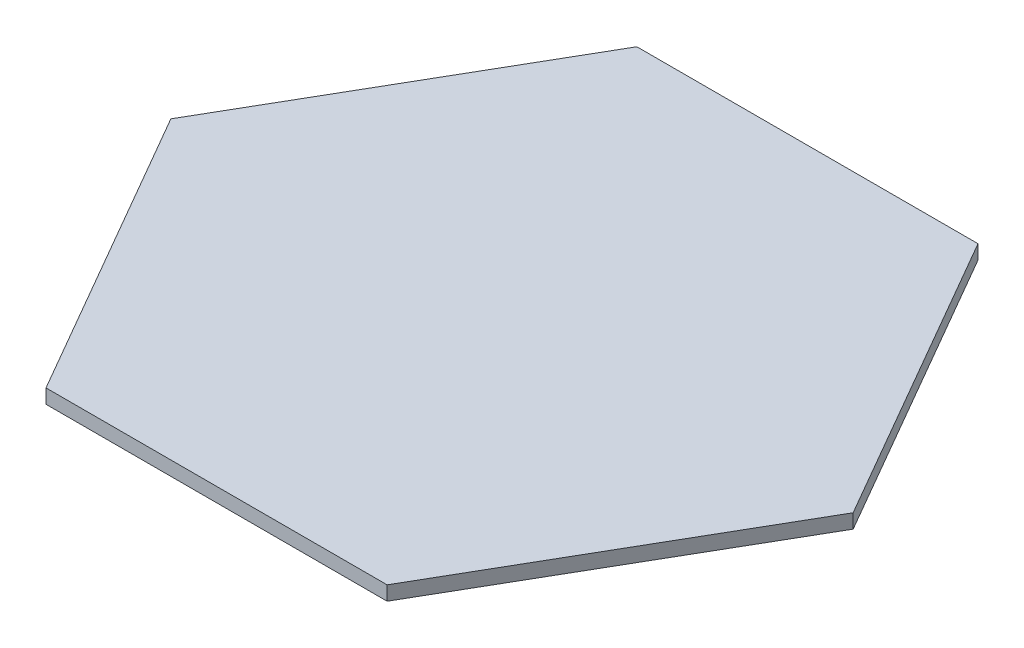
ISO-10303-21;
HEADER;
FILE_DESCRIPTION(('STEP AP214'),'2;1');
FILE_NAME('part.step','',(''),(''),'','','');
FILE_SCHEMA(('AUTOMOTIVE_DESIGN { 1 0 10303 214 1 1 1 1 }'));
ENDSEC;
DATA;
#1=APPLICATION_CONTEXT('core data for automotive mechanical design processes');
#2=APPLICATION_PROTOCOL_DEFINITION('international standard','automotive_design',2000,#1);
#3=PRODUCT_CONTEXT('',#1,'mechanical');
#4=PRODUCT('Part','Part','',(#3));
#5=PRODUCT_RELATED_PRODUCT_CATEGORY('part','',(#4));
#6=PRODUCT_DEFINITION_FORMATION('','',#4);
#7=PRODUCT_DEFINITION_CONTEXT('part definition',#1,'design');
#8=PRODUCT_DEFINITION('design','',#6,#7);
#9=PRODUCT_DEFINITION_SHAPE('','',#8);
#10=(LENGTH_UNIT() NAMED_UNIT(*) SI_UNIT(.MILLI.,.METRE.));
#11=(NAMED_UNIT(*) PLANE_ANGLE_UNIT() SI_UNIT($,.RADIAN.));
#12=(NAMED_UNIT(*) SI_UNIT($,.STERADIAN.) SOLID_ANGLE_UNIT());
#13=UNCERTAINTY_MEASURE_WITH_UNIT(LENGTH_MEASURE(1.E-05),#10,'distance_accuracy_value','');
#14=(GEOMETRIC_REPRESENTATION_CONTEXT(3) GLOBAL_UNCERTAINTY_ASSIGNED_CONTEXT((#13)) GLOBAL_UNIT_ASSIGNED_CONTEXT((#10,
#11,#12)) REPRESENTATION_CONTEXT('',''));
#15=CARTESIAN_POINT('',(0.,0.,0.));
#16=DIRECTION('',(0.,0.,1.));
#17=DIRECTION('',(1.,0.,0.));
#18=AXIS2_PLACEMENT_3D('',#15,#16,#17);
#19=CARTESIAN_POINT('',(38.1000000000007,3.175,65.9911357683737));
#20=DIRECTION('',(-0.866025403784442,0.,-0.499999999999995));
#21=DIRECTION('',(-0.499999999999995,0.,0.866025403784442));
#22=AXIS2_PLACEMENT_3D('',#19,#20,#21);
#23=PLANE('',#22);
#24=DIRECTION('',(0.499999999999995,0.,-0.866025403784442));
#25=VECTOR('',#24,1.);
#26=CARTESIAN_POINT('',(38.1000000000007,0.,65.9911357683737));
#27=LINE('',#26,#25);
#28=CARTESIAN_POINT('',(38.1000000000007,0.,65.9911357683737));
#29=VERTEX_POINT('',#28);
#30=CARTESIAN_POINT('',(76.1999999999998,0.,0.));
#31=VERTEX_POINT('',#30);
#32=EDGE_CURVE('E119',#29,#31,#27,.T.);
#33=ORIENTED_EDGE('',*,*,#32,.T.);
#34=DIRECTION('',(0.,-1.,0.));
#35=VECTOR('',#34,1.);
#36=CARTESIAN_POINT('',(76.1999999999998,3.175,0.));
#37=LINE('',#36,#35);
#38=CARTESIAN_POINT('',(76.1999999999998,3.175,0.));
#39=VERTEX_POINT('',#38);
#40=EDGE_CURVE('E11',#39,#31,#37,.T.);
#41=ORIENTED_EDGE('',*,*,#40,.F.);
#42=DIRECTION('',(0.499999999999995,0.,-0.866025403784442));
#43=VECTOR('',#42,1.);
#44=CARTESIAN_POINT('',(38.1000000000007,3.175,65.9911357683737));
#45=LINE('',#44,#43);
#46=CARTESIAN_POINT('',(38.1000000000007,3.175,65.9911357683737));
#47=VERTEX_POINT('',#46);
#48=EDGE_CURVE('E129',#47,#39,#45,.T.);
#49=ORIENTED_EDGE('',*,*,#48,.F.);
#50=DIRECTION('',(0.,-1.,0.));
#51=VECTOR('',#50,1.);
#52=CARTESIAN_POINT('',(38.1000000000007,3.175,65.9911357683737));
#53=LINE('',#52,#51);
#54=EDGE_CURVE('E115',#47,#29,#53,.T.);
#55=ORIENTED_EDGE('',*,*,#54,.T.);
#56=EDGE_LOOP('',(#33,#41,#49,#55));
#57=FACE_BOUND('',#56,.T.);
#58=ADVANCED_FACE('F35',(#57),#23,.F.);
#59=CARTESIAN_POINT('',(76.1999999999998,3.175,0.));
#60=DIRECTION('',(-0.866025403784438,0.,0.500000000000001));
#61=DIRECTION('',(0.500000000000001,0.,0.866025403784438));
#62=AXIS2_PLACEMENT_3D('',#59,#60,#61);
#63=PLANE('',#62);
#64=DIRECTION('',(-0.500000000000001,0.,-0.866025403784438));
#65=VECTOR('',#64,1.);
#66=CARTESIAN_POINT('',(76.1999999999998,0.,0.));
#67=LINE('',#66,#65);
#68=CARTESIAN_POINT('',(38.0999999999998,0.,-65.9911357683742));
#69=VERTEX_POINT('',#68);
#70=EDGE_CURVE('E122',#31,#69,#67,.T.);
#71=ORIENTED_EDGE('',*,*,#70,.T.);
#72=DIRECTION('',(0.,-1.,0.));
#73=VECTOR('',#72,1.);
#74=CARTESIAN_POINT('',(38.0999999999998,3.175,-65.9911357683742));
#75=LINE('',#74,#73);
#76=CARTESIAN_POINT('',(38.0999999999998,3.175,-65.9911357683742));
#77=VERTEX_POINT('',#76);
#78=EDGE_CURVE('E43',#77,#69,#75,.T.);
#79=ORIENTED_EDGE('',*,*,#78,.F.);
#80=DIRECTION('',(-0.500000000000001,0.,-0.866025403784438));
#81=VECTOR('',#80,1.);
#82=CARTESIAN_POINT('',(76.1999999999998,3.175,0.));
#83=LINE('',#82,#81);
#84=EDGE_CURVE('E88',#39,#77,#83,.T.);
#85=ORIENTED_EDGE('',*,*,#84,.F.);
#86=ORIENTED_EDGE('',*,*,#40,.T.);
#87=EDGE_LOOP('',(#71,#79,#85,#86));
#88=FACE_BOUND('',#87,.T.);
#89=ADVANCED_FACE('F153',(#88),#63,.F.);
#90=CARTESIAN_POINT('',(38.0999999999998,3.175,-65.9911357683742));
#91=DIRECTION('',(0.,0.,1.));
#92=DIRECTION('',(1.,0.,0.));
#93=AXIS2_PLACEMENT_3D('',#90,#91,#92);
#94=PLANE('',#93);
#95=DIRECTION('',(-1.,0.,0.));
#96=VECTOR('',#95,1.);
#97=CARTESIAN_POINT('',(38.0999999999998,0.,-65.9911357683742));
#98=LINE('',#97,#96);
#99=CARTESIAN_POINT('',(-38.1000000000002,0.,-65.9911357683739));
#100=VERTEX_POINT('',#99);
#101=EDGE_CURVE('E124',#69,#100,#98,.T.);
#102=ORIENTED_EDGE('',*,*,#101,.T.);
#103=DIRECTION('',(0.,-1.,0.));
#104=VECTOR('',#103,1.);
#105=CARTESIAN_POINT('',(-38.1000000000002,3.175,-65.9911357683739));
#106=LINE('',#105,#104);
#107=CARTESIAN_POINT('',(-38.1000000000002,3.175,-65.9911357683739));
#108=VERTEX_POINT('',#107);
#109=EDGE_CURVE('E110',#108,#100,#106,.T.);
#110=ORIENTED_EDGE('',*,*,#109,.F.);
#111=DIRECTION('',(-1.,0.,0.));
#112=VECTOR('',#111,1.);
#113=CARTESIAN_POINT('',(38.0999999999998,3.175,-65.9911357683742));
#114=LINE('',#113,#112);
#115=EDGE_CURVE('E101',#77,#108,#114,.T.);
#116=ORIENTED_EDGE('',*,*,#115,.F.);
#117=ORIENTED_EDGE('',*,*,#78,.T.);
#118=EDGE_LOOP('',(#102,#110,#116,#117));
#119=FACE_BOUND('',#118,.T.);
#120=ADVANCED_FACE('F135',(#119),#94,.F.);
#121=CARTESIAN_POINT('',(-38.1000000000002,3.175,-65.9911357683739));
#122=DIRECTION('',(0.866025403784441,0.,0.499999999999995));
#123=DIRECTION('',(0.499999999999995,0.,-0.866025403784442));
#124=AXIS2_PLACEMENT_3D('',#121,#122,#123);
#125=PLANE('',#124);
#126=DIRECTION('',(-0.499999999999995,0.,0.866025403784442));
#127=VECTOR('',#126,1.);
#128=CARTESIAN_POINT('',(-38.1000000000002,0.,-65.9911357683739));
#129=LINE('',#128,#127);
#130=CARTESIAN_POINT('',(-76.1999999999998,0.,5.32101756039692E-13));
#131=VERTEX_POINT('',#130);
#132=EDGE_CURVE('E109',#100,#131,#129,.T.);
#133=ORIENTED_EDGE('',*,*,#132,.T.);
#134=DIRECTION('',(0.,-1.,0.));
#135=VECTOR('',#134,1.);
#136=CARTESIAN_POINT('',(-76.1999999999998,3.175,5.32101756039692E-13));
#137=LINE('',#136,#135);
#138=CARTESIAN_POINT('',(-76.1999999999998,3.175,5.32101756039692E-13));
#139=VERTEX_POINT('',#138);
#140=EDGE_CURVE('E106',#139,#131,#137,.T.);
#141=ORIENTED_EDGE('',*,*,#140,.F.);
#142=DIRECTION('',(-0.499999999999995,0.,0.866025403784442));
#143=VECTOR('',#142,1.);
#144=CARTESIAN_POINT('',(-38.1000000000002,3.175,-65.9911357683739));
#145=LINE('',#144,#143);
#146=EDGE_CURVE('E95',#108,#139,#145,.T.);
#147=ORIENTED_EDGE('',*,*,#146,.F.);
#148=ORIENTED_EDGE('',*,*,#109,.T.);
#149=EDGE_LOOP('',(#133,#141,#147,#148));
#150=FACE_BOUND('',#149,.T.);
#151=ADVANCED_FACE('F107',(#150),#125,.F.);
#152=CARTESIAN_POINT('',(-76.1999999999998,3.175,5.32101756039692E-13));
#153=DIRECTION('',(0.866025403784435,0.,-0.500000000000007));
#154=DIRECTION('',(-0.500000000000007,0.,-0.866025403784435));
#155=AXIS2_PLACEMENT_3D('',#152,#153,#154);
#156=PLANE('',#155);
#157=DIRECTION('',(0.500000000000007,0.,0.866025403784434));
#158=VECTOR('',#157,1.);
#159=CARTESIAN_POINT('',(-76.1999999999998,0.,5.32101756039692E-13));
#160=LINE('',#159,#158);
#161=CARTESIAN_POINT('',(-38.0999999999993,0.,65.9911357683744));
#162=VERTEX_POINT('',#161);
#163=EDGE_CURVE('E74',#131,#162,#160,.T.);
#164=ORIENTED_EDGE('',*,*,#163,.T.);
#165=DIRECTION('',(0.,-1.,0.));
#166=VECTOR('',#165,1.);
#167=CARTESIAN_POINT('',(-38.0999999999993,3.175,65.9911357683744));
#168=LINE('',#167,#166);
#169=CARTESIAN_POINT('',(-38.0999999999993,3.175,65.9911357683744));
#170=VERTEX_POINT('',#169);
#171=EDGE_CURVE('E111',#170,#162,#168,.T.);
#172=ORIENTED_EDGE('',*,*,#171,.F.);
#173=DIRECTION('',(0.500000000000007,0.,0.866025403784434));
#174=VECTOR('',#173,1.);
#175=CARTESIAN_POINT('',(-76.1999999999998,3.175,5.32101756039692E-13));
#176=LINE('',#175,#174);
#177=EDGE_CURVE('E99',#139,#170,#176,.T.);
#178=ORIENTED_EDGE('',*,*,#177,.F.);
#179=ORIENTED_EDGE('',*,*,#140,.T.);
#180=EDGE_LOOP('',(#164,#172,#178,#179));
#181=FACE_BOUND('',#180,.T.);
#182=ADVANCED_FACE('F113',(#181),#156,.F.);
#183=CARTESIAN_POINT('',(-38.0999999999993,3.175,65.9911357683744));
#184=DIRECTION('',(0.,0.,-1.));
#185=DIRECTION('',(-1.,0.,0.));
#186=AXIS2_PLACEMENT_3D('',#183,#184,#185);
#187=PLANE('',#186);
#188=DIRECTION('',(1.,0.,0.));
#189=VECTOR('',#188,1.);
#190=CARTESIAN_POINT('',(-38.0999999999993,0.,65.9911357683744));
#191=LINE('',#190,#189);
#192=EDGE_CURVE('E80',#162,#29,#191,.T.);
#193=ORIENTED_EDGE('',*,*,#192,.T.);
#194=ORIENTED_EDGE('',*,*,#54,.F.);
#195=DIRECTION('',(1.,0.,0.));
#196=VECTOR('',#195,1.);
#197=CARTESIAN_POINT('',(-38.0999999999993,3.175,65.9911357683744));
#198=LINE('',#197,#196);
#199=EDGE_CURVE('E51',#170,#47,#198,.T.);
#200=ORIENTED_EDGE('',*,*,#199,.F.);
#201=ORIENTED_EDGE('',*,*,#171,.T.);
#202=EDGE_LOOP('',(#193,#194,#200,#201));
#203=FACE_BOUND('',#202,.T.);
#204=ADVANCED_FACE('F142',(#203),#187,.F.);
#205=CARTESIAN_POINT('',(0.,3.175,0.));
#206=DIRECTION('',(0.,1.,0.));
#207=DIRECTION('',(0.,0.,1.));
#208=AXIS2_PLACEMENT_3D('',#205,#206,#207);
#209=PLANE('',#208);
#210=ORIENTED_EDGE('',*,*,#48,.T.);
#211=ORIENTED_EDGE('',*,*,#84,.T.);
#212=ORIENTED_EDGE('',*,*,#115,.T.);
#213=ORIENTED_EDGE('',*,*,#146,.T.);
#214=ORIENTED_EDGE('',*,*,#177,.T.);
#215=ORIENTED_EDGE('',*,*,#199,.T.);
#216=EDGE_LOOP('',(#210,#211,#212,#213,#214,#215));
#217=FACE_BOUND('',#216,.T.);
#218=ADVANCED_FACE('F97',(#217),#209,.T.);
#219=CARTESIAN_POINT('',(0.,0.,0.));
#220=DIRECTION('',(0.,1.,0.));
#221=DIRECTION('',(0.,0.,1.));
#222=AXIS2_PLACEMENT_3D('',#219,#220,#221);
#223=PLANE('',#222);
#224=ORIENTED_EDGE('',*,*,#32,.F.);
#225=ORIENTED_EDGE('',*,*,#192,.F.);
#226=ORIENTED_EDGE('',*,*,#163,.F.);
#227=ORIENTED_EDGE('',*,*,#132,.F.);
#228=ORIENTED_EDGE('',*,*,#101,.F.);
#229=ORIENTED_EDGE('',*,*,#70,.F.);
#230=EDGE_LOOP('',(#224,#225,#226,#227,#228,#229));
#231=FACE_BOUND('',#230,.T.);
#232=ADVANCED_FACE('F138',(#231),#223,.F.);
#233=CLOSED_SHELL('',(#58,#89,#120,#151,#182,#204,#218,#232));
#234=MANIFOLD_SOLID_BREP('B2',#233);
#235=ADVANCED_BREP_SHAPE_REPRESENTATION('',(#18,#234),#14);
#236=SHAPE_DEFINITION_REPRESENTATION(#9,#235);
ENDSEC;
END-ISO-10303-21;
